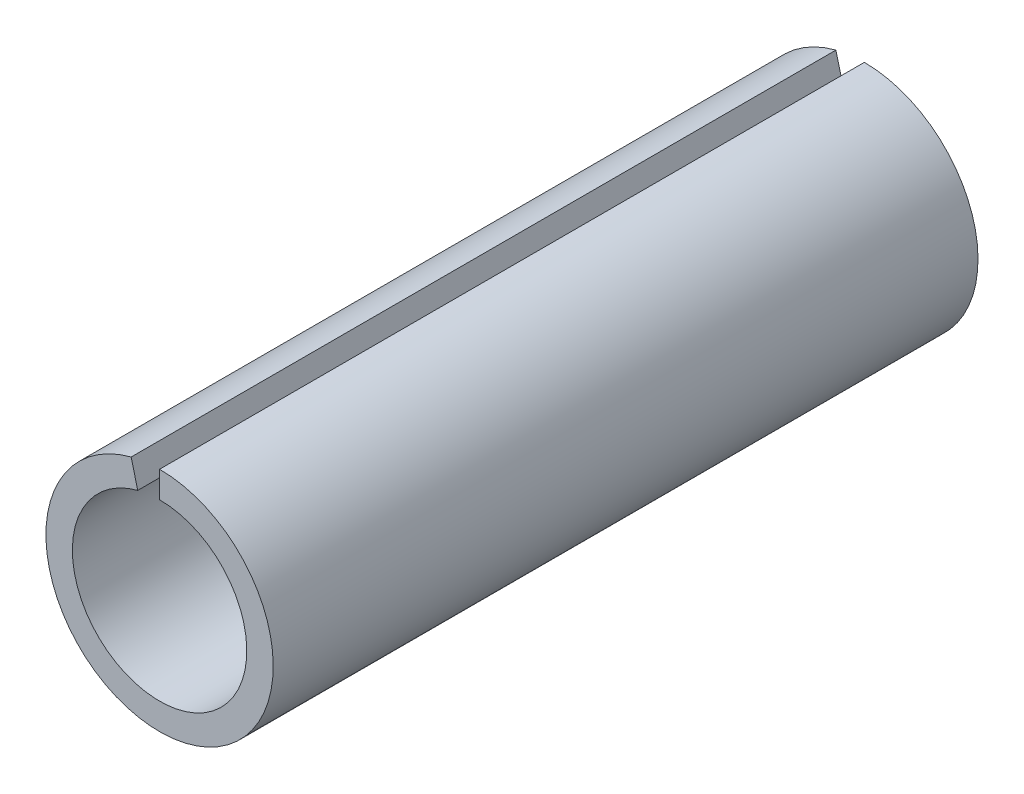
ISO-10303-21;
HEADER;
FILE_DESCRIPTION(('STEP AP214'),'2;1');
FILE_NAME('part.step','',(''),(''),'','','');
FILE_SCHEMA(('AUTOMOTIVE_DESIGN { 1 0 10303 214 1 1 1 1 }'));
ENDSEC;
DATA;
#1=APPLICATION_CONTEXT('core data for automotive mechanical design processes');
#2=APPLICATION_PROTOCOL_DEFINITION('international standard','automotive_design',2000,#1);
#3=PRODUCT_CONTEXT('',#1,'mechanical');
#4=PRODUCT('Part','Part','',(#3));
#5=PRODUCT_RELATED_PRODUCT_CATEGORY('part','',(#4));
#6=PRODUCT_DEFINITION_FORMATION('','',#4);
#7=PRODUCT_DEFINITION_CONTEXT('part definition',#1,'design');
#8=PRODUCT_DEFINITION('design','',#6,#7);
#9=PRODUCT_DEFINITION_SHAPE('','',#8);
#10=(LENGTH_UNIT() NAMED_UNIT(*) SI_UNIT(.MILLI.,.METRE.));
#11=(NAMED_UNIT(*) PLANE_ANGLE_UNIT() SI_UNIT($,.RADIAN.));
#12=(NAMED_UNIT(*) SI_UNIT($,.STERADIAN.) SOLID_ANGLE_UNIT());
#13=UNCERTAINTY_MEASURE_WITH_UNIT(LENGTH_MEASURE(1.E-05),#10,'distance_accuracy_value','');
#14=(GEOMETRIC_REPRESENTATION_CONTEXT(3) GLOBAL_UNCERTAINTY_ASSIGNED_CONTEXT((#13)) GLOBAL_UNIT_ASSIGNED_CONTEXT((#10,
#11,#12)) REPRESENTATION_CONTEXT('',''));
#15=CARTESIAN_POINT('',(0.,0.,0.));
#16=DIRECTION('',(0.,0.,1.));
#17=DIRECTION('',(1.,0.,0.));
#18=AXIS2_PLACEMENT_3D('',#15,#16,#17);
#19=CARTESIAN_POINT('',(0.,0.,40.));
#20=DIRECTION('',(0.,0.,-1.));
#21=DIRECTION('',(-1.,0.,0.));
#22=AXIS2_PLACEMENT_3D('',#19,#20,#21);
#23=CYLINDRICAL_SURFACE('',#22,6.45);
#24=CARTESIAN_POINT('',(0.,0.,0.));
#25=DIRECTION('',(0.,0.,1.));
#26=DIRECTION('',(1.,0.,0.));
#27=AXIS2_PLACEMENT_3D('',#24,#25,#26);
#28=CIRCLE('',#27,6.45);
#29=CARTESIAN_POINT('',(-1.61444660461327,6.24468271098322,0.));
#30=VERTEX_POINT('',#29);
#31=CARTESIAN_POINT('',(0.,6.45,0.));
#32=VERTEX_POINT('',#31);
#33=EDGE_CURVE('E100',#30,#32,#28,.T.);
#34=ORIENTED_EDGE('',*,*,#33,.T.);
#35=DIRECTION('',(0.,0.,-1.));
#36=VECTOR('',#35,1.);
#37=CARTESIAN_POINT('',(0.,6.45,40.));
#38=LINE('',#37,#36);
#39=CARTESIAN_POINT('',(0.,6.45,40.));
#40=VERTEX_POINT('',#39);
#41=EDGE_CURVE('E11',#40,#32,#38,.T.);
#42=ORIENTED_EDGE('',*,*,#41,.F.);
#43=CARTESIAN_POINT('',(0.,0.,40.));
#44=DIRECTION('',(0.,0.,1.));
#45=DIRECTION('',(1.,0.,0.));
#46=AXIS2_PLACEMENT_3D('',#43,#44,#45);
#47=CIRCLE('',#46,6.45);
#48=CARTESIAN_POINT('',(-1.61444660461327,6.24468271098322,40.));
#49=VERTEX_POINT('',#48);
#50=EDGE_CURVE('E88',#49,#40,#47,.T.);
#51=ORIENTED_EDGE('',*,*,#50,.F.);
#52=DIRECTION('',(0.,0.,-1.));
#53=VECTOR('',#52,1.);
#54=CARTESIAN_POINT('',(-1.61444660461327,6.24468271098322,40.));
#55=LINE('',#54,#53);
#56=EDGE_CURVE('E96',#49,#30,#55,.T.);
#57=ORIENTED_EDGE('',*,*,#56,.T.);
#58=EDGE_LOOP('',(#34,#42,#51,#57));
#59=FACE_BOUND('',#58,.T.);
#60=ADVANCED_FACE('F37',(#59),#23,.T.);
#61=CARTESIAN_POINT('',(0.,4.95,40.));
#62=DIRECTION('',(1.,0.,0.));
#63=DIRECTION('',(0.,0.,-1.));
#64=AXIS2_PLACEMENT_3D('',#61,#62,#63);
#65=PLANE('',#64);
#66=DIRECTION('',(0.,-1.,0.));
#67=VECTOR('',#66,1.);
#68=CARTESIAN_POINT('',(0.,4.95,0.));
#69=LINE('',#68,#67);
#70=CARTESIAN_POINT('',(0.,4.95,0.));
#71=VERTEX_POINT('',#70);
#72=EDGE_CURVE('E92',#32,#71,#69,.T.);
#73=ORIENTED_EDGE('',*,*,#72,.T.);
#74=DIRECTION('',(0.,0.,-1.));
#75=VECTOR('',#74,1.);
#76=CARTESIAN_POINT('',(0.,4.95,40.));
#77=LINE('',#76,#75);
#78=CARTESIAN_POINT('',(0.,4.95,40.));
#79=VERTEX_POINT('',#78);
#80=EDGE_CURVE('E45',#79,#71,#77,.T.);
#81=ORIENTED_EDGE('',*,*,#80,.F.);
#82=DIRECTION('',(0.,-1.,0.));
#83=VECTOR('',#82,1.);
#84=CARTESIAN_POINT('',(0.,4.95,40.));
#85=LINE('',#84,#83);
#86=EDGE_CURVE('E83',#40,#79,#85,.T.);
#87=ORIENTED_EDGE('',*,*,#86,.F.);
#88=ORIENTED_EDGE('',*,*,#41,.T.);
#89=EDGE_LOOP('',(#73,#81,#87,#88));
#90=FACE_BOUND('',#89,.T.);
#91=ADVANCED_FACE('F91',(#90),#65,.F.);
#92=CARTESIAN_POINT('',(0.,0.,40.));
#93=DIRECTION('',(0.,0.,-1.));
#94=DIRECTION('',(-1.,0.,0.));
#95=AXIS2_PLACEMENT_3D('',#92,#93,#94);
#96=CYLINDRICAL_SURFACE('',#95,4.95);
#97=CARTESIAN_POINT('',(0.,0.,0.));
#98=DIRECTION('',(0.,0.,-1.));
#99=DIRECTION('',(1.,0.,0.));
#100=AXIS2_PLACEMENT_3D('',#97,#98,#99);
#101=CIRCLE('',#100,4.95);
#102=CARTESIAN_POINT('',(-1.238993905866,4.7924309177313,0.));
#103=VERTEX_POINT('',#102);
#104=EDGE_CURVE('E70',#71,#103,#101,.T.);
#105=ORIENTED_EDGE('',*,*,#104,.T.);
#106=DIRECTION('',(0.,0.,-1.));
#107=VECTOR('',#106,1.);
#108=CARTESIAN_POINT('',(-1.238993905866,4.7924309177313,40.));
#109=LINE('',#108,#107);
#110=CARTESIAN_POINT('',(-1.238993905866,4.7924309177313,40.));
#111=VERTEX_POINT('',#110);
#112=EDGE_CURVE('E93',#111,#103,#109,.T.);
#113=ORIENTED_EDGE('',*,*,#112,.F.);
#114=CARTESIAN_POINT('',(0.,0.,40.));
#115=DIRECTION('',(0.,0.,-1.));
#116=DIRECTION('',(1.,0.,0.));
#117=AXIS2_PLACEMENT_3D('',#114,#115,#116);
#118=CIRCLE('',#117,4.95);
#119=EDGE_CURVE('E86',#79,#111,#118,.T.);
#120=ORIENTED_EDGE('',*,*,#119,.F.);
#121=ORIENTED_EDGE('',*,*,#80,.T.);
#122=EDGE_LOOP('',(#105,#113,#120,#121));
#123=FACE_BOUND('',#122,.T.);
#124=ADVANCED_FACE('F94',(#123),#96,.F.);
#125=CARTESIAN_POINT('',(-1.61444660461327,6.24468271098322,40.));
#126=DIRECTION('',(-0.96816786216794,-0.250301799164849,0.));
#127=DIRECTION('',(0.250301799164849,-0.96816786216794,0.));
#128=AXIS2_PLACEMENT_3D('',#125,#126,#127);
#129=PLANE('',#128);
#130=DIRECTION('',(-0.250301799164849,0.96816786216794,0.));
#131=VECTOR('',#130,1.);
#132=CARTESIAN_POINT('',(-1.61444660461327,6.24468271098322,0.));
#133=LINE('',#132,#131);
#134=EDGE_CURVE('E76',#103,#30,#133,.T.);
#135=ORIENTED_EDGE('',*,*,#134,.T.);
#136=ORIENTED_EDGE('',*,*,#56,.F.);
#137=DIRECTION('',(-0.250301799164849,0.96816786216794,0.));
#138=VECTOR('',#137,1.);
#139=CARTESIAN_POINT('',(-1.61444660461327,6.24468271098322,40.));
#140=LINE('',#139,#138);
#141=EDGE_CURVE('E53',#111,#49,#140,.T.);
#142=ORIENTED_EDGE('',*,*,#141,.F.);
#143=ORIENTED_EDGE('',*,*,#112,.T.);
#144=EDGE_LOOP('',(#135,#136,#142,#143));
#145=FACE_BOUND('',#144,.T.);
#146=ADVANCED_FACE('F107',(#145),#129,.F.);
#147=CARTESIAN_POINT('',(0.,0.,40.));
#148=DIRECTION('',(0.,0.,1.));
#149=DIRECTION('',(1.,0.,0.));
#150=AXIS2_PLACEMENT_3D('',#147,#148,#149);
#151=PLANE('',#150);
#152=ORIENTED_EDGE('',*,*,#50,.T.);
#153=ORIENTED_EDGE('',*,*,#86,.T.);
#154=ORIENTED_EDGE('',*,*,#119,.T.);
#155=ORIENTED_EDGE('',*,*,#141,.T.);
#156=EDGE_LOOP('',(#152,#153,#154,#155));
#157=FACE_BOUND('',#156,.T.);
#158=ADVANCED_FACE('F84',(#157),#151,.T.);
#159=CARTESIAN_POINT('',(0.,0.,0.));
#160=DIRECTION('',(0.,0.,1.));
#161=DIRECTION('',(1.,0.,0.));
#162=AXIS2_PLACEMENT_3D('',#159,#160,#161);
#163=PLANE('',#162);
#164=ORIENTED_EDGE('',*,*,#33,.F.);
#165=ORIENTED_EDGE('',*,*,#134,.F.);
#166=ORIENTED_EDGE('',*,*,#104,.F.);
#167=ORIENTED_EDGE('',*,*,#72,.F.);
#168=EDGE_LOOP('',(#164,#165,#166,#167));
#169=FACE_BOUND('',#168,.T.);
#170=ADVANCED_FACE('F110',(#169),#163,.F.);
#171=CLOSED_SHELL('',(#60,#91,#124,#146,#158,#170));
#172=MANIFOLD_SOLID_BREP('B2',#171);
#173=ADVANCED_BREP_SHAPE_REPRESENTATION('',(#18,#172),#14);
#174=SHAPE_DEFINITION_REPRESENTATION(#9,#173);
ENDSEC;
END-ISO-10303-21;
